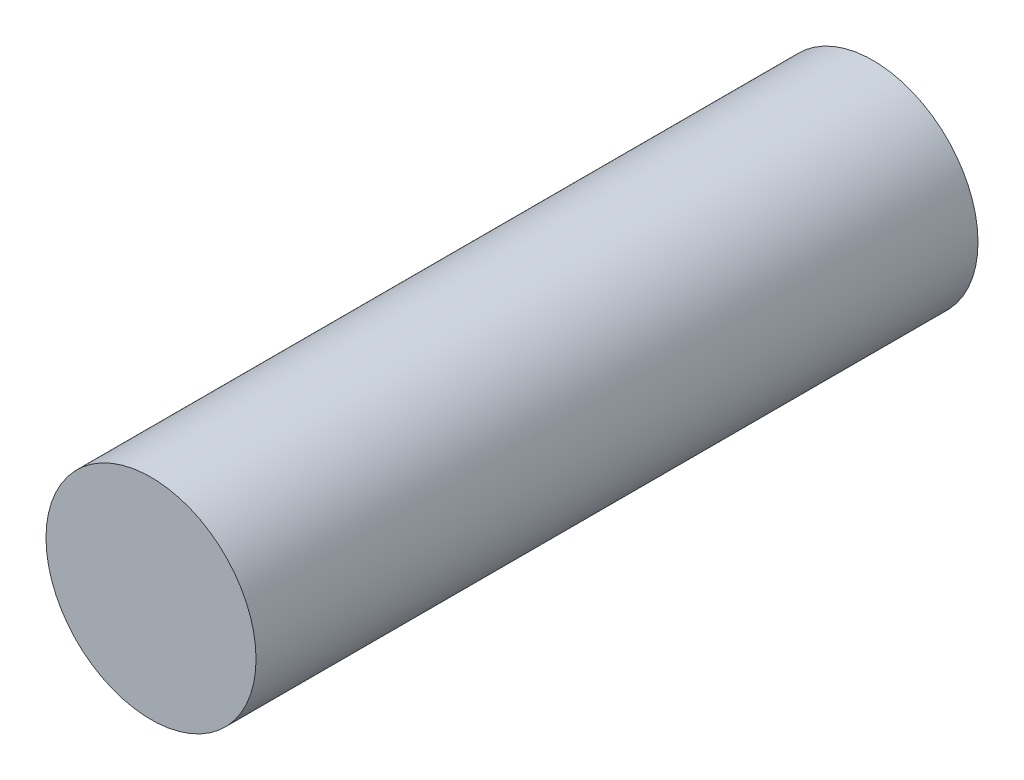
ISO-10303-21;
HEADER;
FILE_DESCRIPTION(('STEP AP214'),'2;1');
FILE_NAME('part.step','',(''),(''),'','','');
FILE_SCHEMA(('AUTOMOTIVE_DESIGN { 1 0 10303 214 1 1 1 1 }'));
ENDSEC;
DATA;
#1=APPLICATION_CONTEXT('core data for automotive mechanical design processes');
#2=APPLICATION_PROTOCOL_DEFINITION('international standard','automotive_design',2000,#1);
#3=PRODUCT_CONTEXT('',#1,'mechanical');
#4=PRODUCT('Part','Part','',(#3));
#5=PRODUCT_RELATED_PRODUCT_CATEGORY('part','',(#4));
#6=PRODUCT_DEFINITION_FORMATION('','',#4);
#7=PRODUCT_DEFINITION_CONTEXT('part definition',#1,'design');
#8=PRODUCT_DEFINITION('design','',#6,#7);
#9=PRODUCT_DEFINITION_SHAPE('','',#8);
#10=(LENGTH_UNIT() NAMED_UNIT(*) SI_UNIT(.MILLI.,.METRE.));
#11=(NAMED_UNIT(*) PLANE_ANGLE_UNIT() SI_UNIT($,.RADIAN.));
#12=(NAMED_UNIT(*) SI_UNIT($,.STERADIAN.) SOLID_ANGLE_UNIT());
#13=UNCERTAINTY_MEASURE_WITH_UNIT(LENGTH_MEASURE(1.E-05),#10,'distance_accuracy_value','');
#14=(GEOMETRIC_REPRESENTATION_CONTEXT(3) GLOBAL_UNCERTAINTY_ASSIGNED_CONTEXT((#13)) GLOBAL_UNIT_ASSIGNED_CONTEXT((#10,
#11,#12)) REPRESENTATION_CONTEXT('',''));
#15=CARTESIAN_POINT('',(0.,0.,0.));
#16=DIRECTION('',(0.,0.,1.));
#17=DIRECTION('',(1.,0.,0.));
#18=AXIS2_PLACEMENT_3D('',#15,#16,#17);
#19=CARTESIAN_POINT('',(0.3999992,0.,0.));
#20=DIRECTION('',(0.,0.,-1.));
#21=DIRECTION('',(-1.,0.,0.));
#22=AXIS2_PLACEMENT_3D('',#19,#20,#21);
#23=PLANE('',#22);
#24=CARTESIAN_POINT('',(0.,0.,0.));
#25=DIRECTION('',(0.,0.,-1.));
#26=DIRECTION('',(-1.,0.,0.));
#27=AXIS2_PLACEMENT_3D('',#24,#25,#26);
#28=CIRCLE('',#27,0.3999992);
#29=CARTESIAN_POINT('',(-0.3999992,0.,0.));
#30=VERTEX_POINT('',#29);
#31=EDGE_CURVE('E18',#30,#30,#28,.F.);
#32=ORIENTED_EDGE('',*,*,#31,.F.);
#33=EDGE_LOOP('',(#32));
#34=FACE_BOUND('',#33,.T.);
#35=ADVANCED_FACE('F15',(#34),#23,.T.);
#36=CARTESIAN_POINT('',(0.3999992,0.,2.74999958));
#37=DIRECTION('',(0.,0.,-1.));
#38=DIRECTION('',(-1.,0.,0.));
#39=AXIS2_PLACEMENT_3D('',#36,#37,#38);
#40=PLANE('',#39);
#41=CARTESIAN_POINT('',(0.,0.,2.74999958));
#42=DIRECTION('',(0.,0.,-1.));
#43=DIRECTION('',(-1.,0.,0.));
#44=AXIS2_PLACEMENT_3D('',#41,#42,#43);
#45=CIRCLE('',#44,0.3999992);
#46=CARTESIAN_POINT('',(-0.3999992,0.,2.74999958));
#47=VERTEX_POINT('',#46);
#48=EDGE_CURVE('E10',#47,#47,#45,.T.);
#49=ORIENTED_EDGE('',*,*,#48,.F.);
#50=EDGE_LOOP('',(#49));
#51=FACE_BOUND('',#50,.T.);
#52=ADVANCED_FACE('F30',(#51),#40,.F.);
#53=CARTESIAN_POINT('',(0.,0.,0.));
#54=DIRECTION('',(0.,0.,-1.));
#55=DIRECTION('',(-1.,0.,0.));
#56=AXIS2_PLACEMENT_3D('',#53,#54,#55);
#57=CYLINDRICAL_SURFACE('',#56,0.3999992);
#58=ORIENTED_EDGE('',*,*,#48,.T.);
#59=EDGE_LOOP('',(#58));
#60=FACE_BOUND('',#59,.T.);
#61=ORIENTED_EDGE('',*,*,#31,.T.);
#62=EDGE_LOOP('',(#61));
#63=FACE_BOUND('',#62,.T.);
#64=ADVANCED_FACE('F27',(#60,#63),#57,.T.);
#65=CLOSED_SHELL('',(#35,#52,#64));
#66=MANIFOLD_SOLID_BREP('B1',#65);
#67=ADVANCED_BREP_SHAPE_REPRESENTATION('',(#18,#66),#14);
#68=SHAPE_DEFINITION_REPRESENTATION(#9,#67);
ENDSEC;
END-ISO-10303-21;
